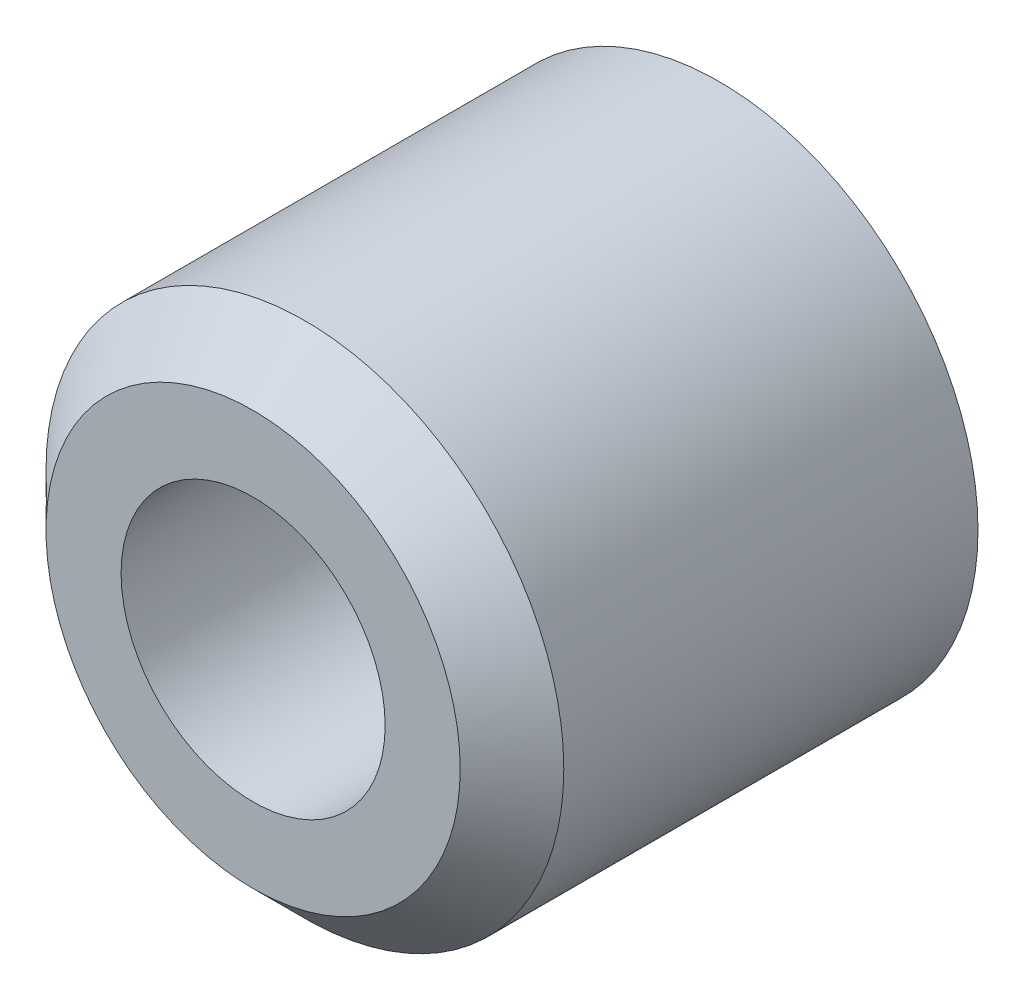
ISO-10303-21;
HEADER;
FILE_DESCRIPTION(('STEP AP214'),'2;1');
FILE_NAME('part.step','',(''),(''),'','','');
FILE_SCHEMA(('AUTOMOTIVE_DESIGN { 1 0 10303 214 1 1 1 1 }'));
ENDSEC;
DATA;
#1=APPLICATION_CONTEXT('core data for automotive mechanical design processes');
#2=APPLICATION_PROTOCOL_DEFINITION('international standard','automotive_design',2000,#1);
#3=PRODUCT_CONTEXT('',#1,'mechanical');
#4=PRODUCT('Part','Part','',(#3));
#5=PRODUCT_RELATED_PRODUCT_CATEGORY('part','',(#4));
#6=PRODUCT_DEFINITION_FORMATION('','',#4);
#7=PRODUCT_DEFINITION_CONTEXT('part definition',#1,'design');
#8=PRODUCT_DEFINITION('design','',#6,#7);
#9=PRODUCT_DEFINITION_SHAPE('','',#8);
#10=(LENGTH_UNIT() NAMED_UNIT(*) SI_UNIT(.MILLI.,.METRE.));
#11=(NAMED_UNIT(*) PLANE_ANGLE_UNIT() SI_UNIT($,.RADIAN.));
#12=(NAMED_UNIT(*) SI_UNIT($,.STERADIAN.) SOLID_ANGLE_UNIT());
#13=UNCERTAINTY_MEASURE_WITH_UNIT(LENGTH_MEASURE(1.E-05),#10,'distance_accuracy_value','');
#14=(GEOMETRIC_REPRESENTATION_CONTEXT(3) GLOBAL_UNCERTAINTY_ASSIGNED_CONTEXT((#13)) GLOBAL_UNIT_ASSIGNED_CONTEXT((#10,
#11,#12)) REPRESENTATION_CONTEXT('',''));
#15=CARTESIAN_POINT('',(0.,0.,0.));
#16=DIRECTION('',(0.,0.,1.));
#17=DIRECTION('',(1.,0.,0.));
#18=AXIS2_PLACEMENT_3D('',#15,#16,#17);
#19=CARTESIAN_POINT('',(0.,0.,9.));
#20=DIRECTION('',(0.,0.,1.));
#21=DIRECTION('',(1.,0.,0.));
#22=AXIS2_PLACEMENT_3D('',#19,#20,#21);
#23=PLANE('',#22);
#24=CARTESIAN_POINT('',(0.,0.,9.));
#25=DIRECTION('',(0.,0.,1.));
#26=DIRECTION('',(1.,0.,0.));
#27=AXIS2_PLACEMENT_3D('',#24,#25,#26);
#28=CIRCLE('',#27,4.);
#29=CARTESIAN_POINT('',(4.,0.,9.));
#30=VERTEX_POINT('',#29);
#31=EDGE_CURVE('E41',#30,#30,#28,.T.);
#32=ORIENTED_EDGE('',*,*,#31,.T.);
#33=EDGE_LOOP('',(#32));
#34=FACE_BOUND('',#33,.T.);
#35=CARTESIAN_POINT('',(0.,0.,9.));
#36=DIRECTION('',(0.,0.,1.));
#37=DIRECTION('',(1.,0.,0.));
#38=AXIS2_PLACEMENT_3D('',#35,#36,#37);
#39=CIRCLE('',#38,2.55);
#40=CARTESIAN_POINT('',(2.55,0.,9.));
#41=VERTEX_POINT('',#40);
#42=EDGE_CURVE('E49',#41,#41,#39,.T.);
#43=ORIENTED_EDGE('',*,*,#42,.F.);
#44=EDGE_LOOP('',(#43));
#45=FACE_BOUND('',#44,.T.);
#46=ADVANCED_FACE('F34',(#34,#45),#23,.T.);
#47=CARTESIAN_POINT('',(0.,0.,0.));
#48=DIRECTION('',(0.,0.,1.));
#49=DIRECTION('',(1.,0.,0.));
#50=AXIS2_PLACEMENT_3D('',#47,#48,#49);
#51=PLANE('',#50);
#52=CARTESIAN_POINT('',(0.,0.,0.));
#53=DIRECTION('',(0.,0.,1.));
#54=DIRECTION('',(1.,0.,0.));
#55=AXIS2_PLACEMENT_3D('',#52,#53,#54);
#56=CIRCLE('',#55,5.);
#57=CARTESIAN_POINT('',(5.,0.,0.));
#58=VERTEX_POINT('',#57);
#59=EDGE_CURVE('E45',#58,#58,#56,.T.);
#60=ORIENTED_EDGE('',*,*,#59,.F.);
#61=EDGE_LOOP('',(#60));
#62=FACE_BOUND('',#61,.T.);
#63=CARTESIAN_POINT('',(0.,0.,0.));
#64=DIRECTION('',(0.,0.,1.));
#65=DIRECTION('',(1.,0.,0.));
#66=AXIS2_PLACEMENT_3D('',#63,#64,#65);
#67=CIRCLE('',#66,2.55);
#68=CARTESIAN_POINT('',(2.55,0.,0.));
#69=VERTEX_POINT('',#68);
#70=EDGE_CURVE('E52',#69,#69,#67,.T.);
#71=ORIENTED_EDGE('',*,*,#70,.T.);
#72=EDGE_LOOP('',(#71));
#73=FACE_BOUND('',#72,.T.);
#74=ADVANCED_FACE('F62',(#62,#73),#51,.F.);
#75=CARTESIAN_POINT('',(0.,0.,9.));
#76=DIRECTION('',(0.,0.,-1.));
#77=DIRECTION('',(-1.,0.,0.));
#78=AXIS2_PLACEMENT_3D('',#75,#76,#77);
#79=CYLINDRICAL_SURFACE('',#78,5.);
#80=CARTESIAN_POINT('',(0.,0.,8.));
#81=DIRECTION('',(0.,0.,1.));
#82=DIRECTION('',(1.,0.,0.));
#83=AXIS2_PLACEMENT_3D('',#80,#81,#82);
#84=CIRCLE('',#83,5.);
#85=CARTESIAN_POINT('',(5.,0.,8.));
#86=VERTEX_POINT('',#85);
#87=EDGE_CURVE('E10',#86,#86,#84,.F.);
#88=ORIENTED_EDGE('',*,*,#87,.T.);
#89=EDGE_LOOP('',(#88));
#90=FACE_BOUND('',#89,.T.);
#91=ORIENTED_EDGE('',*,*,#59,.T.);
#92=EDGE_LOOP('',(#91));
#93=FACE_BOUND('',#92,.T.);
#94=ADVANCED_FACE('F67',(#90,#93),#79,.T.);
#95=CARTESIAN_POINT('',(0.,0.,9.));
#96=DIRECTION('',(0.,0.,-1.));
#97=DIRECTION('',(-1.,0.,0.));
#98=AXIS2_PLACEMENT_3D('',#95,#96,#97);
#99=CYLINDRICAL_SURFACE('',#98,2.55);
#100=ORIENTED_EDGE('',*,*,#42,.T.);
#101=EDGE_LOOP('',(#100));
#102=FACE_BOUND('',#101,.T.);
#103=ORIENTED_EDGE('',*,*,#70,.F.);
#104=EDGE_LOOP('',(#103));
#105=FACE_BOUND('',#104,.T.);
#106=ADVANCED_FACE('F58',(#102,#105),#99,.F.);
#107=CARTESIAN_POINT('',(0.,0.,9.));
#108=DIRECTION('',(0.,0.,-1.));
#109=DIRECTION('',(-1.,0.,0.));
#110=AXIS2_PLACEMENT_3D('',#107,#108,#109);
#111=CONICAL_SURFACE('',#110,4.,0.785398163397448);
#112=ORIENTED_EDGE('',*,*,#87,.F.);
#113=EDGE_LOOP('',(#112));
#114=FACE_BOUND('',#113,.T.);
#115=ORIENTED_EDGE('',*,*,#31,.F.);
#116=EDGE_LOOP('',(#115));
#117=FACE_BOUND('',#116,.T.);
#118=ADVANCED_FACE('F36',(#114,#117),#111,.T.);
#119=CLOSED_SHELL('',(#46,#74,#94,#106,#118));
#120=MANIFOLD_SOLID_BREP('B2',#119);
#121=ADVANCED_BREP_SHAPE_REPRESENTATION('',(#18,#120),#14);
#122=SHAPE_DEFINITION_REPRESENTATION(#9,#121);
ENDSEC;
END-ISO-10303-21;
